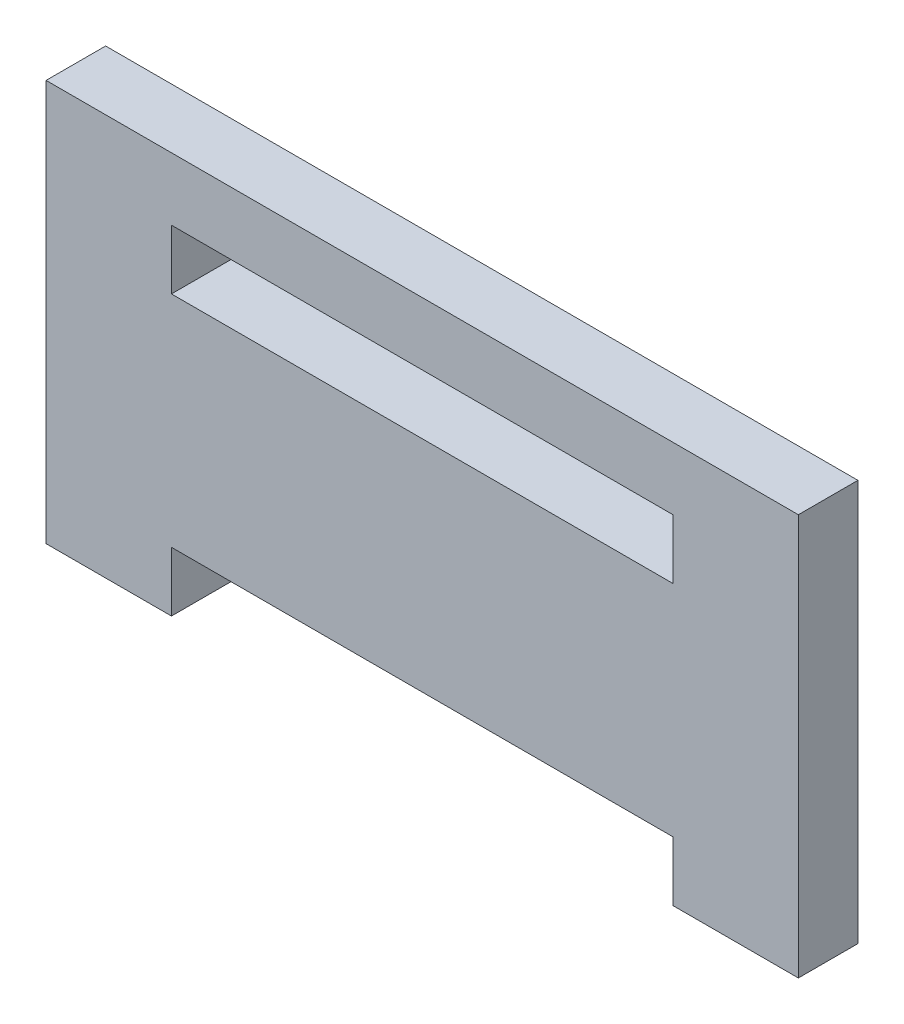
ISO-10303-21;
HEADER;
FILE_DESCRIPTION(('STEP AP214'),'2;1');
FILE_NAME('part.step','',(''),(''),'','','');
FILE_SCHEMA(('AUTOMOTIVE_DESIGN { 1 0 10303 214 1 1 1 1 }'));
ENDSEC;
DATA;
#1=APPLICATION_CONTEXT('core data for automotive mechanical design processes');
#2=APPLICATION_PROTOCOL_DEFINITION('international standard','automotive_design',2000,#1);
#3=PRODUCT_CONTEXT('',#1,'mechanical');
#4=PRODUCT('Part','Part','',(#3));
#5=PRODUCT_RELATED_PRODUCT_CATEGORY('part','',(#4));
#6=PRODUCT_DEFINITION_FORMATION('','',#4);
#7=PRODUCT_DEFINITION_CONTEXT('part definition',#1,'design');
#8=PRODUCT_DEFINITION('design','',#6,#7);
#9=PRODUCT_DEFINITION_SHAPE('','',#8);
#10=(LENGTH_UNIT() NAMED_UNIT(*) SI_UNIT(.MILLI.,.METRE.));
#11=(NAMED_UNIT(*) PLANE_ANGLE_UNIT() SI_UNIT($,.RADIAN.));
#12=(NAMED_UNIT(*) SI_UNIT($,.STERADIAN.) SOLID_ANGLE_UNIT());
#13=UNCERTAINTY_MEASURE_WITH_UNIT(LENGTH_MEASURE(1.E-05),#10,'distance_accuracy_value','');
#14=(GEOMETRIC_REPRESENTATION_CONTEXT(3) GLOBAL_UNCERTAINTY_ASSIGNED_CONTEXT((#13)) GLOBAL_UNIT_ASSIGNED_CONTEXT((#10,
#11,#12)) REPRESENTATION_CONTEXT('',''));
#15=CARTESIAN_POINT('',(0.,0.,0.));
#16=DIRECTION('',(0.,0.,1.));
#17=DIRECTION('',(1.,0.,0.));
#18=AXIS2_PLACEMENT_3D('',#15,#16,#17);
#19=CARTESIAN_POINT('',(0.,0.,4.75));
#20=DIRECTION('',(1.,0.,0.));
#21=DIRECTION('',(0.,0.,-1.));
#22=AXIS2_PLACEMENT_3D('',#19,#20,#21);
#23=PLANE('',#22);
#24=DIRECTION('',(0.,-1.,0.));
#25=VECTOR('',#24,1.);
#26=CARTESIAN_POINT('',(0.,0.,0.));
#27=LINE('',#26,#25);
#28=CARTESIAN_POINT('',(0.,32.,0.));
#29=VERTEX_POINT('',#28);
#30=CARTESIAN_POINT('',(0.,0.,0.));
#31=VERTEX_POINT('',#30);
#32=EDGE_CURVE('E141',#29,#31,#27,.T.);
#33=ORIENTED_EDGE('',*,*,#32,.T.);
#34=DIRECTION('',(0.,0.,-1.));
#35=VECTOR('',#34,1.);
#36=CARTESIAN_POINT('',(0.,0.,4.75));
#37=LINE('',#36,#35);
#38=CARTESIAN_POINT('',(0.,0.,4.75));
#39=VERTEX_POINT('',#38);
#40=EDGE_CURVE('E11',#39,#31,#37,.T.);
#41=ORIENTED_EDGE('',*,*,#40,.F.);
#42=DIRECTION('',(0.,-1.,0.));
#43=VECTOR('',#42,1.);
#44=CARTESIAN_POINT('',(0.,0.,4.75));
#45=LINE('',#44,#43);
#46=CARTESIAN_POINT('',(0.,32.,4.75));
#47=VERTEX_POINT('',#46);
#48=EDGE_CURVE('E161',#47,#39,#45,.T.);
#49=ORIENTED_EDGE('',*,*,#48,.F.);
#50=DIRECTION('',(0.,0.,1.));
#51=VECTOR('',#50,1.);
#52=CARTESIAN_POINT('',(0.,32.,0.));
#53=LINE('',#52,#51);
#54=EDGE_CURVE('E227',#29,#47,#53,.T.);
#55=ORIENTED_EDGE('',*,*,#54,.F.);
#56=EDGE_LOOP('',(#33,#41,#49,#55));
#57=FACE_BOUND('',#56,.T.);
#58=ADVANCED_FACE('F32',(#57),#23,.F.);
#59=CARTESIAN_POINT('',(0.,0.,4.75));
#60=DIRECTION('',(0.,1.,0.));
#61=DIRECTION('',(0.,0.,1.));
#62=AXIS2_PLACEMENT_3D('',#59,#60,#61);
#63=PLANE('',#62);
#64=DIRECTION('',(1.,0.,0.));
#65=VECTOR('',#64,1.);
#66=CARTESIAN_POINT('',(0.,0.,0.));
#67=LINE('',#66,#65);
#68=CARTESIAN_POINT('',(10.,0.,0.));
#69=VERTEX_POINT('',#68);
#70=EDGE_CURVE('E144',#31,#69,#67,.T.);
#71=ORIENTED_EDGE('',*,*,#70,.T.);
#72=DIRECTION('',(0.,0.,-1.));
#73=VECTOR('',#72,1.);
#74=CARTESIAN_POINT('',(10.,0.,4.75));
#75=LINE('',#74,#73);
#76=CARTESIAN_POINT('',(10.,0.,4.75));
#77=VERTEX_POINT('',#76);
#78=EDGE_CURVE('E40',#77,#69,#75,.T.);
#79=ORIENTED_EDGE('',*,*,#78,.F.);
#80=DIRECTION('',(1.,0.,0.));
#81=VECTOR('',#80,1.);
#82=CARTESIAN_POINT('',(0.,0.,4.75));
#83=LINE('',#82,#81);
#84=EDGE_CURVE('E95',#39,#77,#83,.T.);
#85=ORIENTED_EDGE('',*,*,#84,.F.);
#86=ORIENTED_EDGE('',*,*,#40,.T.);
#87=EDGE_LOOP('',(#71,#79,#85,#86));
#88=FACE_BOUND('',#87,.T.);
#89=ADVANCED_FACE('F243',(#88),#63,.F.);
#90=CARTESIAN_POINT('',(10.,0.,4.75));
#91=DIRECTION('',(-1.,0.,0.));
#92=DIRECTION('',(0.,0.,1.));
#93=AXIS2_PLACEMENT_3D('',#90,#91,#92);
#94=PLANE('',#93);
#95=DIRECTION('',(0.,1.,0.));
#96=VECTOR('',#95,1.);
#97=CARTESIAN_POINT('',(10.,0.,0.));
#98=LINE('',#97,#96);
#99=CARTESIAN_POINT('',(10.,4.75,0.));
#100=VERTEX_POINT('',#99);
#101=EDGE_CURVE('E147',#69,#100,#98,.T.);
#102=ORIENTED_EDGE('',*,*,#101,.T.);
#103=DIRECTION('',(0.,0.,-1.));
#104=VECTOR('',#103,1.);
#105=CARTESIAN_POINT('',(10.,4.75,4.75));
#106=LINE('',#105,#104);
#107=CARTESIAN_POINT('',(10.,4.75,4.75));
#108=VERTEX_POINT('',#107);
#109=EDGE_CURVE('E174',#108,#100,#106,.T.);
#110=ORIENTED_EDGE('',*,*,#109,.F.);
#111=DIRECTION('',(0.,1.,0.));
#112=VECTOR('',#111,1.);
#113=CARTESIAN_POINT('',(10.,0.,4.75));
#114=LINE('',#113,#112);
#115=EDGE_CURVE('E182',#77,#108,#114,.T.);
#116=ORIENTED_EDGE('',*,*,#115,.F.);
#117=ORIENTED_EDGE('',*,*,#78,.T.);
#118=EDGE_LOOP('',(#102,#110,#116,#117));
#119=FACE_BOUND('',#118,.T.);
#120=ADVANCED_FACE('F180',(#119),#94,.F.);
#121=CARTESIAN_POINT('',(10.,4.75,4.75));
#122=DIRECTION('',(0.,1.,0.));
#123=DIRECTION('',(0.,0.,1.));
#124=AXIS2_PLACEMENT_3D('',#121,#122,#123);
#125=PLANE('',#124);
#126=DIRECTION('',(1.,0.,0.));
#127=VECTOR('',#126,1.);
#128=CARTESIAN_POINT('',(10.,4.75,0.));
#129=LINE('',#128,#127);
#130=CARTESIAN_POINT('',(50.,4.75,0.));
#131=VERTEX_POINT('',#130);
#132=EDGE_CURVE('E149',#100,#131,#129,.T.);
#133=ORIENTED_EDGE('',*,*,#132,.T.);
#134=DIRECTION('',(0.,0.,-1.));
#135=VECTOR('',#134,1.);
#136=CARTESIAN_POINT('',(50.,4.75,4.75));
#137=LINE('',#136,#135);
#138=CARTESIAN_POINT('',(50.,4.75,4.75));
#139=VERTEX_POINT('',#138);
#140=EDGE_CURVE('E171',#139,#131,#137,.T.);
#141=ORIENTED_EDGE('',*,*,#140,.F.);
#142=DIRECTION('',(1.,0.,0.));
#143=VECTOR('',#142,1.);
#144=CARTESIAN_POINT('',(10.,4.75,4.75));
#145=LINE('',#144,#143);
#146=EDGE_CURVE('E202',#108,#139,#145,.T.);
#147=ORIENTED_EDGE('',*,*,#146,.F.);
#148=ORIENTED_EDGE('',*,*,#109,.T.);
#149=EDGE_LOOP('',(#133,#141,#147,#148));
#150=FACE_BOUND('',#149,.T.);
#151=ADVANCED_FACE('F192',(#150),#125,.F.);
#152=CARTESIAN_POINT('',(50.,0.,4.75));
#153=DIRECTION('',(1.,0.,0.));
#154=DIRECTION('',(0.,0.,-1.));
#155=AXIS2_PLACEMENT_3D('',#152,#153,#154);
#156=PLANE('',#155);
#157=DIRECTION('',(0.,-1.,0.));
#158=VECTOR('',#157,1.);
#159=CARTESIAN_POINT('',(50.,0.,0.));
#160=LINE('',#159,#158);
#161=CARTESIAN_POINT('',(50.,0.,0.));
#162=VERTEX_POINT('',#161);
#163=EDGE_CURVE('E151',#131,#162,#160,.T.);
#164=ORIENTED_EDGE('',*,*,#163,.T.);
#165=DIRECTION('',(0.,0.,-1.));
#166=VECTOR('',#165,1.);
#167=CARTESIAN_POINT('',(50.,0.,4.75));
#168=LINE('',#167,#166);
#169=CARTESIAN_POINT('',(50.,0.,4.75));
#170=VERTEX_POINT('',#169);
#171=EDGE_CURVE('E168',#170,#162,#168,.T.);
#172=ORIENTED_EDGE('',*,*,#171,.F.);
#173=DIRECTION('',(0.,-1.,0.));
#174=VECTOR('',#173,1.);
#175=CARTESIAN_POINT('',(50.,0.,4.75));
#176=LINE('',#175,#174);
#177=EDGE_CURVE('E198',#139,#170,#176,.T.);
#178=ORIENTED_EDGE('',*,*,#177,.F.);
#179=ORIENTED_EDGE('',*,*,#140,.T.);
#180=EDGE_LOOP('',(#164,#172,#178,#179));
#181=FACE_BOUND('',#180,.T.);
#182=ADVANCED_FACE('F196',(#181),#156,.F.);
#183=CARTESIAN_POINT('',(50.,0.,4.75));
#184=DIRECTION('',(0.,1.,0.));
#185=DIRECTION('',(0.,0.,1.));
#186=AXIS2_PLACEMENT_3D('',#183,#184,#185);
#187=PLANE('',#186);
#188=DIRECTION('',(1.,0.,0.));
#189=VECTOR('',#188,1.);
#190=CARTESIAN_POINT('',(50.,0.,0.));
#191=LINE('',#190,#189);
#192=CARTESIAN_POINT('',(60.,0.,0.));
#193=VERTEX_POINT('',#192);
#194=EDGE_CURVE('E153',#162,#193,#191,.T.);
#195=ORIENTED_EDGE('',*,*,#194,.T.);
#196=DIRECTION('',(0.,0.,-1.));
#197=VECTOR('',#196,1.);
#198=CARTESIAN_POINT('',(60.,0.,4.75));
#199=LINE('',#198,#197);
#200=CARTESIAN_POINT('',(60.,0.,4.75));
#201=VERTEX_POINT('',#200);
#202=EDGE_CURVE('E165',#201,#193,#199,.T.);
#203=ORIENTED_EDGE('',*,*,#202,.F.);
#204=DIRECTION('',(1.,0.,0.));
#205=VECTOR('',#204,1.);
#206=CARTESIAN_POINT('',(50.,0.,4.75));
#207=LINE('',#206,#205);
#208=EDGE_CURVE('E201',#170,#201,#207,.T.);
#209=ORIENTED_EDGE('',*,*,#208,.F.);
#210=ORIENTED_EDGE('',*,*,#171,.T.);
#211=EDGE_LOOP('',(#195,#203,#209,#210));
#212=FACE_BOUND('',#211,.T.);
#213=ADVANCED_FACE('F255',(#212),#187,.F.);
#214=CARTESIAN_POINT('',(60.,0.,4.75));
#215=DIRECTION('',(-1.,0.,0.));
#216=DIRECTION('',(0.,-1.,0.));
#217=AXIS2_PLACEMENT_3D('',#214,#215,#216);
#218=PLANE('',#217);
#219=DIRECTION('',(0.,1.,0.));
#220=VECTOR('',#219,1.);
#221=CARTESIAN_POINT('',(60.,0.,0.));
#222=LINE('',#221,#220);
#223=CARTESIAN_POINT('',(60.,32.,0.));
#224=VERTEX_POINT('',#223);
#225=EDGE_CURVE('E155',#193,#224,#222,.T.);
#226=ORIENTED_EDGE('',*,*,#225,.T.);
#227=DIRECTION('',(0.,0.,-1.));
#228=VECTOR('',#227,1.);
#229=CARTESIAN_POINT('',(60.,32.,0.));
#230=LINE('',#229,#228);
#231=CARTESIAN_POINT('',(60.,32.,4.75));
#232=VERTEX_POINT('',#231);
#233=EDGE_CURVE('E224',#232,#224,#230,.T.);
#234=ORIENTED_EDGE('',*,*,#233,.F.);
#235=DIRECTION('',(0.,1.,0.));
#236=VECTOR('',#235,1.);
#237=CARTESIAN_POINT('',(60.,0.,4.75));
#238=LINE('',#237,#236);
#239=EDGE_CURVE('E126',#201,#232,#238,.T.);
#240=ORIENTED_EDGE('',*,*,#239,.F.);
#241=ORIENTED_EDGE('',*,*,#202,.T.);
#242=EDGE_LOOP('',(#226,#234,#240,#241));
#243=FACE_BOUND('',#242,.T.);
#244=ADVANCED_FACE('F229',(#243),#218,.F.);
#245=CARTESIAN_POINT('',(50.,27.,4.75));
#246=DIRECTION('',(1.,0.,0.));
#247=DIRECTION('',(0.,0.,-1.));
#248=AXIS2_PLACEMENT_3D('',#245,#246,#247);
#249=PLANE('',#248);
#250=DIRECTION('',(0.,-1.,0.));
#251=VECTOR('',#250,1.);
#252=CARTESIAN_POINT('',(50.,27.,0.));
#253=LINE('',#252,#251);
#254=CARTESIAN_POINT('',(50.,27.,0.));
#255=VERTEX_POINT('',#254);
#256=CARTESIAN_POINT('',(50.,22.25,0.));
#257=VERTEX_POINT('',#256);
#258=EDGE_CURVE('E131',#255,#257,#253,.T.);
#259=ORIENTED_EDGE('',*,*,#258,.T.);
#260=DIRECTION('',(0.,0.,-1.));
#261=VECTOR('',#260,1.);
#262=CARTESIAN_POINT('',(50.,22.25,4.75));
#263=LINE('',#262,#261);
#264=CARTESIAN_POINT('',(50.,22.25,4.75));
#265=VERTEX_POINT('',#264);
#266=EDGE_CURVE('E128',#265,#257,#263,.T.);
#267=ORIENTED_EDGE('',*,*,#266,.F.);
#268=DIRECTION('',(0.,-1.,0.));
#269=VECTOR('',#268,1.);
#270=CARTESIAN_POINT('',(50.,27.,4.75));
#271=LINE('',#270,#269);
#272=CARTESIAN_POINT('',(50.,27.,4.75));
#273=VERTEX_POINT('',#272);
#274=EDGE_CURVE('E116',#273,#265,#271,.T.);
#275=ORIENTED_EDGE('',*,*,#274,.F.);
#276=DIRECTION('',(0.,0.,-1.));
#277=VECTOR('',#276,1.);
#278=CARTESIAN_POINT('',(50.,27.,4.75));
#279=LINE('',#278,#277);
#280=EDGE_CURVE('E132',#273,#255,#279,.T.);
#281=ORIENTED_EDGE('',*,*,#280,.T.);
#282=EDGE_LOOP('',(#259,#267,#275,#281));
#283=FACE_BOUND('',#282,.T.);
#284=ADVANCED_FACE('F129',(#283),#249,.F.);
#285=CARTESIAN_POINT('',(10.,22.25,4.75));
#286=DIRECTION('',(0.,-1.,0.));
#287=DIRECTION('',(0.,0.,-1.));
#288=AXIS2_PLACEMENT_3D('',#285,#286,#287);
#289=PLANE('',#288);
#290=DIRECTION('',(-1.,0.,0.));
#291=VECTOR('',#290,1.);
#292=CARTESIAN_POINT('',(10.,22.25,0.));
#293=LINE('',#292,#291);
#294=CARTESIAN_POINT('',(10.,22.25,0.));
#295=VERTEX_POINT('',#294);
#296=EDGE_CURVE('E81',#257,#295,#293,.T.);
#297=ORIENTED_EDGE('',*,*,#296,.T.);
#298=DIRECTION('',(0.,0.,-1.));
#299=VECTOR('',#298,1.);
#300=CARTESIAN_POINT('',(10.,22.25,4.75));
#301=LINE('',#300,#299);
#302=CARTESIAN_POINT('',(10.,22.25,4.75));
#303=VERTEX_POINT('',#302);
#304=EDGE_CURVE('E133',#303,#295,#301,.T.);
#305=ORIENTED_EDGE('',*,*,#304,.F.);
#306=DIRECTION('',(-1.,0.,0.));
#307=VECTOR('',#306,1.);
#308=CARTESIAN_POINT('',(10.,22.25,4.75));
#309=LINE('',#308,#307);
#310=EDGE_CURVE('E120',#265,#303,#309,.T.);
#311=ORIENTED_EDGE('',*,*,#310,.F.);
#312=ORIENTED_EDGE('',*,*,#266,.T.);
#313=EDGE_LOOP('',(#297,#305,#311,#312));
#314=FACE_BOUND('',#313,.T.);
#315=ADVANCED_FACE('F135',(#314),#289,.F.);
#316=CARTESIAN_POINT('',(10.,27.,4.75));
#317=DIRECTION('',(-1.,0.,0.));
#318=DIRECTION('',(0.,0.,1.));
#319=AXIS2_PLACEMENT_3D('',#316,#317,#318);
#320=PLANE('',#319);
#321=DIRECTION('',(0.,1.,0.));
#322=VECTOR('',#321,1.);
#323=CARTESIAN_POINT('',(10.,27.,0.));
#324=LINE('',#323,#322);
#325=CARTESIAN_POINT('',(10.,27.,0.));
#326=VERTEX_POINT('',#325);
#327=EDGE_CURVE('E87',#295,#326,#324,.T.);
#328=ORIENTED_EDGE('',*,*,#327,.T.);
#329=DIRECTION('',(0.,0.,-1.));
#330=VECTOR('',#329,1.);
#331=CARTESIAN_POINT('',(10.,27.,4.75));
#332=LINE('',#331,#330);
#333=CARTESIAN_POINT('',(10.,27.,4.75));
#334=VERTEX_POINT('',#333);
#335=EDGE_CURVE('E137',#334,#326,#332,.T.);
#336=ORIENTED_EDGE('',*,*,#335,.F.);
#337=DIRECTION('',(0.,1.,0.));
#338=VECTOR('',#337,1.);
#339=CARTESIAN_POINT('',(10.,27.,4.75));
#340=LINE('',#339,#338);
#341=EDGE_CURVE('E48',#303,#334,#340,.T.);
#342=ORIENTED_EDGE('',*,*,#341,.F.);
#343=ORIENTED_EDGE('',*,*,#304,.T.);
#344=EDGE_LOOP('',(#328,#336,#342,#343));
#345=FACE_BOUND('',#344,.T.);
#346=ADVANCED_FACE('F265',(#345),#320,.F.);
#347=CARTESIAN_POINT('',(0.,0.,4.75));
#348=DIRECTION('',(0.,0.,-1.));
#349=DIRECTION('',(-1.,0.,0.));
#350=AXIS2_PLACEMENT_3D('',#347,#348,#349);
#351=PLANE('',#350);
#352=DIRECTION('',(1.,0.,0.));
#353=VECTOR('',#352,1.);
#354=CARTESIAN_POINT('',(0.,32.,4.75));
#355=LINE('',#354,#353);
#356=EDGE_CURVE('E213',#47,#232,#355,.T.);
#357=ORIENTED_EDGE('',*,*,#356,.F.);
#358=ORIENTED_EDGE('',*,*,#48,.T.);
#359=ORIENTED_EDGE('',*,*,#84,.T.);
#360=ORIENTED_EDGE('',*,*,#115,.T.);
#361=ORIENTED_EDGE('',*,*,#146,.T.);
#362=ORIENTED_EDGE('',*,*,#177,.T.);
#363=ORIENTED_EDGE('',*,*,#208,.T.);
#364=ORIENTED_EDGE('',*,*,#239,.T.);
#365=EDGE_LOOP('',(#357,#358,#359,#360,#361,#362,#363,#364));
#366=FACE_BOUND('',#365,.T.);
#367=ORIENTED_EDGE('',*,*,#341,.T.);
#368=DIRECTION('',(1.,0.,0.));
#369=VECTOR('',#368,1.);
#370=CARTESIAN_POINT('',(0.,27.,4.75));
#371=LINE('',#370,#369);
#372=EDGE_CURVE('E122',#334,#273,#371,.T.);
#373=ORIENTED_EDGE('',*,*,#372,.T.);
#374=ORIENTED_EDGE('',*,*,#274,.T.);
#375=ORIENTED_EDGE('',*,*,#310,.T.);
#376=EDGE_LOOP('',(#367,#373,#374,#375));
#377=FACE_BOUND('',#376,.T.);
#378=ADVANCED_FACE('F118',(#366,#377),#351,.F.);
#379=CARTESIAN_POINT('',(0.,0.,0.));
#380=DIRECTION('',(0.,0.,-1.));
#381=DIRECTION('',(-1.,0.,0.));
#382=AXIS2_PLACEMENT_3D('',#379,#380,#381);
#383=PLANE('',#382);
#384=ORIENTED_EDGE('',*,*,#32,.F.);
#385=DIRECTION('',(-1.,0.,0.));
#386=VECTOR('',#385,1.);
#387=CARTESIAN_POINT('',(0.,32.,0.));
#388=LINE('',#387,#386);
#389=EDGE_CURVE('E145',#224,#29,#388,.T.);
#390=ORIENTED_EDGE('',*,*,#389,.F.);
#391=ORIENTED_EDGE('',*,*,#225,.F.);
#392=ORIENTED_EDGE('',*,*,#194,.F.);
#393=ORIENTED_EDGE('',*,*,#163,.F.);
#394=ORIENTED_EDGE('',*,*,#132,.F.);
#395=ORIENTED_EDGE('',*,*,#101,.F.);
#396=ORIENTED_EDGE('',*,*,#70,.F.);
#397=EDGE_LOOP('',(#384,#390,#391,#392,#393,#394,#395,#396));
#398=FACE_BOUND('',#397,.T.);
#399=DIRECTION('',(-1.,0.,0.));
#400=VECTOR('',#399,1.);
#401=CARTESIAN_POINT('',(0.,27.,0.));
#402=LINE('',#401,#400);
#403=EDGE_CURVE('E236',#255,#326,#402,.T.);
#404=ORIENTED_EDGE('',*,*,#403,.T.);
#405=ORIENTED_EDGE('',*,*,#327,.F.);
#406=ORIENTED_EDGE('',*,*,#296,.F.);
#407=ORIENTED_EDGE('',*,*,#258,.F.);
#408=EDGE_LOOP('',(#404,#405,#406,#407));
#409=FACE_BOUND('',#408,.T.);
#410=ADVANCED_FACE('F186',(#398,#409),#383,.T.);
#411=CARTESIAN_POINT('',(0.,27.,0.));
#412=DIRECTION('',(0.,1.,0.));
#413=DIRECTION('',(0.,0.,1.));
#414=AXIS2_PLACEMENT_3D('',#411,#412,#413);
#415=PLANE('',#414);
#416=ORIENTED_EDGE('',*,*,#403,.F.);
#417=ORIENTED_EDGE('',*,*,#280,.F.);
#418=ORIENTED_EDGE('',*,*,#372,.F.);
#419=ORIENTED_EDGE('',*,*,#335,.T.);
#420=EDGE_LOOP('',(#416,#417,#418,#419));
#421=FACE_BOUND('',#420,.T.);
#422=ADVANCED_FACE('F270',(#421),#415,.F.);
#423=CARTESIAN_POINT('',(0.,32.,0.));
#424=DIRECTION('',(0.,1.,0.));
#425=DIRECTION('',(0.,0.,1.));
#426=AXIS2_PLACEMENT_3D('',#423,#424,#425);
#427=PLANE('',#426);
#428=ORIENTED_EDGE('',*,*,#54,.T.);
#429=ORIENTED_EDGE('',*,*,#356,.T.);
#430=ORIENTED_EDGE('',*,*,#233,.T.);
#431=ORIENTED_EDGE('',*,*,#389,.T.);
#432=EDGE_LOOP('',(#428,#429,#430,#431));
#433=FACE_BOUND('',#432,.T.);
#434=ADVANCED_FACE('F222',(#433),#427,.T.);
#435=CLOSED_SHELL('',(#58,#89,#120,#151,#182,#213,#244,#284,#315,#346,#378,#410,#422,#434));
#436=MANIFOLD_SOLID_BREP('B2',#435);
#437=ADVANCED_BREP_SHAPE_REPRESENTATION('',(#18,#436),#14);
#438=SHAPE_DEFINITION_REPRESENTATION(#9,#437);
ENDSEC;
END-ISO-10303-21;
